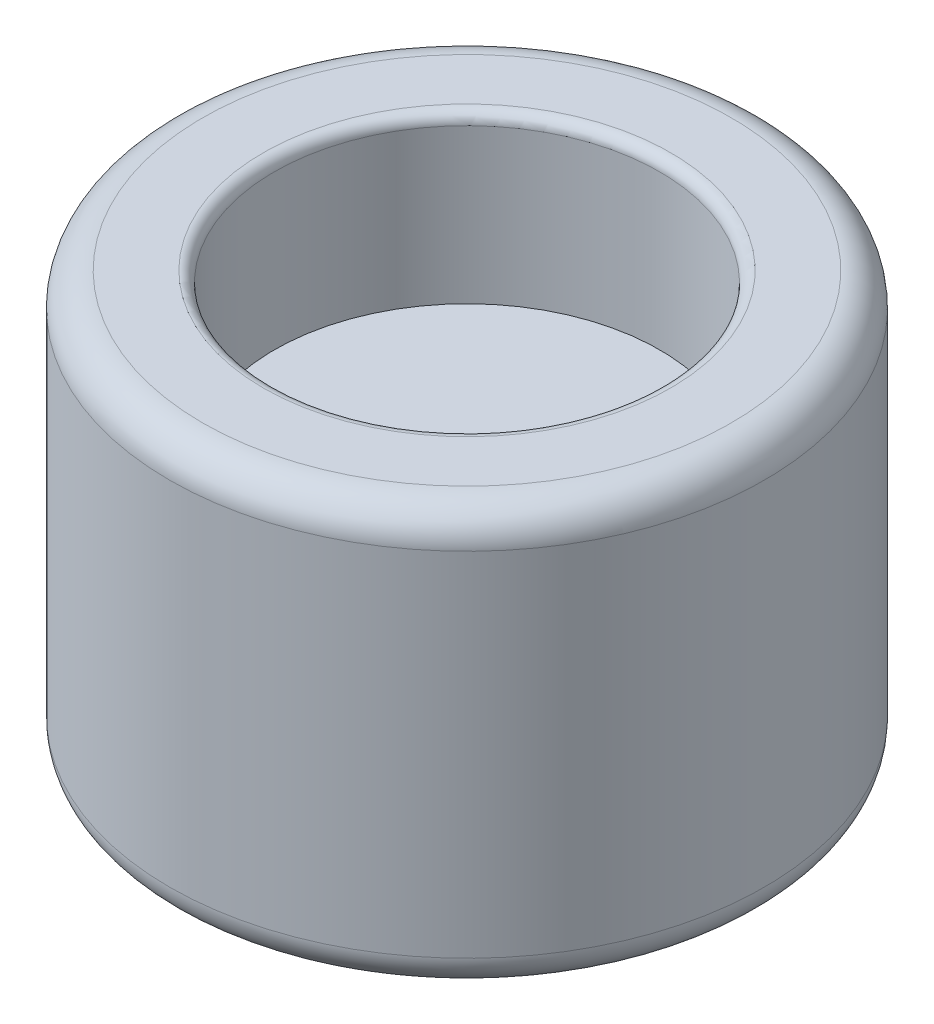
ISO-10303-21;
HEADER;
FILE_DESCRIPTION(('STEP AP214'),'2;1');
FILE_NAME('part.step','',(''),(''),'','','');
FILE_SCHEMA(('AUTOMOTIVE_DESIGN { 1 0 10303 214 1 1 1 1 }'));
ENDSEC;
DATA;
#1=APPLICATION_CONTEXT('core data for automotive mechanical design processes');
#2=APPLICATION_PROTOCOL_DEFINITION('international standard','automotive_design',2000,#1);
#3=PRODUCT_CONTEXT('',#1,'mechanical');
#4=PRODUCT('Part','Part','',(#3));
#5=PRODUCT_RELATED_PRODUCT_CATEGORY('part','',(#4));
#6=PRODUCT_DEFINITION_FORMATION('','',#4);
#7=PRODUCT_DEFINITION_CONTEXT('part definition',#1,'design');
#8=PRODUCT_DEFINITION('design','',#6,#7);
#9=PRODUCT_DEFINITION_SHAPE('','',#8);
#10=(LENGTH_UNIT() NAMED_UNIT(*) SI_UNIT(.MILLI.,.METRE.));
#11=(NAMED_UNIT(*) PLANE_ANGLE_UNIT() SI_UNIT($,.RADIAN.));
#12=(NAMED_UNIT(*) SI_UNIT($,.STERADIAN.) SOLID_ANGLE_UNIT());
#13=UNCERTAINTY_MEASURE_WITH_UNIT(LENGTH_MEASURE(1.E-05),#10,'distance_accuracy_value','');
#14=(GEOMETRIC_REPRESENTATION_CONTEXT(3) GLOBAL_UNCERTAINTY_ASSIGNED_CONTEXT((#13)) GLOBAL_UNIT_ASSIGNED_CONTEXT((#10,
#11,#12)) REPRESENTATION_CONTEXT('',''));
#15=CARTESIAN_POINT('',(0.,0.,0.));
#16=DIRECTION('',(0.,0.,1.));
#17=DIRECTION('',(1.,0.,0.));
#18=AXIS2_PLACEMENT_3D('',#15,#16,#17);
#19=CARTESIAN_POINT('',(0.,38.,0.));
#20=DIRECTION('',(0.,-1.,0.));
#21=DIRECTION('',(0.,0.,-1.));
#22=AXIS2_PLACEMENT_3D('',#19,#20,#21);
#23=CYLINDRICAL_SURFACE('',#22,27.);
#24=CARTESIAN_POINT('',(0.,3.,0.));
#25=DIRECTION('',(0.,1.,0.));
#26=DIRECTION('',(0.,0.,1.));
#27=AXIS2_PLACEMENT_3D('',#24,#25,#26);
#28=CIRCLE('',#27,27.);
#29=CARTESIAN_POINT('',(0.,3.,27.));
#30=VERTEX_POINT('',#29);
#31=EDGE_CURVE('E54',#30,#30,#28,.T.);
#32=ORIENTED_EDGE('',*,*,#31,.T.);
#33=EDGE_LOOP('',(#32));
#34=FACE_BOUND('',#33,.T.);
#35=CARTESIAN_POINT('',(0.,35.,0.));
#36=DIRECTION('',(0.,1.,0.));
#37=DIRECTION('',(0.,0.,1.));
#38=AXIS2_PLACEMENT_3D('',#35,#36,#37);
#39=CIRCLE('',#38,27.);
#40=CARTESIAN_POINT('',(0.,35.,27.));
#41=VERTEX_POINT('',#40);
#42=EDGE_CURVE('E57',#41,#41,#39,.F.);
#43=ORIENTED_EDGE('',*,*,#42,.T.);
#44=EDGE_LOOP('',(#43));
#45=FACE_BOUND('',#44,.T.);
#46=ADVANCED_FACE('F31',(#34,#45),#23,.T.);
#47=CARTESIAN_POINT('',(0.,38.,0.));
#48=DIRECTION('',(0.,1.,0.));
#49=DIRECTION('',(0.,0.,1.));
#50=AXIS2_PLACEMENT_3D('',#47,#48,#49);
#51=PLANE('',#50);
#52=CARTESIAN_POINT('',(0.,38.,0.));
#53=DIRECTION('',(0.,1.,0.));
#54=DIRECTION('',(0.,0.,1.));
#55=AXIS2_PLACEMENT_3D('',#52,#53,#54);
#56=CIRCLE('',#55,18.5);
#57=CARTESIAN_POINT('',(0.,38.,18.5));
#58=VERTEX_POINT('',#57);
#59=EDGE_CURVE('E42',#58,#58,#56,.F.);
#60=ORIENTED_EDGE('',*,*,#59,.T.);
#61=EDGE_LOOP('',(#60));
#62=FACE_BOUND('',#61,.T.);
#63=CARTESIAN_POINT('',(0.,38.,0.));
#64=DIRECTION('',(0.,1.,0.));
#65=DIRECTION('',(0.,0.,1.));
#66=AXIS2_PLACEMENT_3D('',#63,#64,#65);
#67=CIRCLE('',#66,24.);
#68=CARTESIAN_POINT('',(0.,38.,24.));
#69=VERTEX_POINT('',#68);
#70=EDGE_CURVE('E60',#69,#69,#67,.T.);
#71=ORIENTED_EDGE('',*,*,#70,.T.);
#72=EDGE_LOOP('',(#71));
#73=FACE_BOUND('',#72,.T.);
#74=ADVANCED_FACE('F96',(#62,#73),#51,.T.);
#75=CARTESIAN_POINT('',(0.,0.,0.));
#76=DIRECTION('',(0.,1.,0.));
#77=DIRECTION('',(0.,0.,1.));
#78=AXIS2_PLACEMENT_3D('',#75,#76,#77);
#79=PLANE('',#78);
#80=CARTESIAN_POINT('',(0.,0.,0.));
#81=DIRECTION('',(0.,1.,0.));
#82=DIRECTION('',(0.,0.,1.));
#83=AXIS2_PLACEMENT_3D('',#80,#81,#82);
#84=CIRCLE('',#83,18.5);
#85=CARTESIAN_POINT('',(0.,0.,18.5));
#86=VERTEX_POINT('',#85);
#87=EDGE_CURVE('E10',#86,#86,#84,.T.);
#88=ORIENTED_EDGE('',*,*,#87,.T.);
#89=EDGE_LOOP('',(#88));
#90=FACE_BOUND('',#89,.T.);
#91=CARTESIAN_POINT('',(0.,0.,0.));
#92=DIRECTION('',(0.,1.,0.));
#93=DIRECTION('',(0.,0.,1.));
#94=AXIS2_PLACEMENT_3D('',#91,#92,#93);
#95=CIRCLE('',#94,24.);
#96=CARTESIAN_POINT('',(0.,0.,24.));
#97=VERTEX_POINT('',#96);
#98=EDGE_CURVE('E51',#97,#97,#95,.F.);
#99=ORIENTED_EDGE('',*,*,#98,.T.);
#100=EDGE_LOOP('',(#99));
#101=FACE_BOUND('',#100,.T.);
#102=ADVANCED_FACE('F102',(#90,#101),#79,.F.);
#103=CARTESIAN_POINT('',(0.,35.,0.));
#104=DIRECTION('',(0.,1.,0.));
#105=DIRECTION('',(0.,0.,1.));
#106=AXIS2_PLACEMENT_3D('',#103,#104,#105);
#107=TOROIDAL_SURFACE('',#106,24.,3.);
#108=ORIENTED_EDGE('',*,*,#42,.F.);
#109=EDGE_LOOP('',(#108));
#110=FACE_BOUND('',#109,.T.);
#111=ORIENTED_EDGE('',*,*,#70,.F.);
#112=EDGE_LOOP('',(#111));
#113=FACE_BOUND('',#112,.T.);
#114=ADVANCED_FACE('F108',(#110,#113),#107,.T.);
#115=CARTESIAN_POINT('',(0.,3.,0.));
#116=DIRECTION('',(0.,1.,0.));
#117=DIRECTION('',(0.,0.,1.));
#118=AXIS2_PLACEMENT_3D('',#115,#116,#117);
#119=TOROIDAL_SURFACE('',#118,24.,3.);
#120=ORIENTED_EDGE('',*,*,#98,.F.);
#121=EDGE_LOOP('',(#120));
#122=FACE_BOUND('',#121,.T.);
#123=ORIENTED_EDGE('',*,*,#31,.F.);
#124=EDGE_LOOP('',(#123));
#125=FACE_BOUND('',#124,.T.);
#126=ADVANCED_FACE('F111',(#122,#125),#119,.T.);
#127=CARTESIAN_POINT('',(0.,15.,0.));
#128=DIRECTION('',(0.,-1.,0.));
#129=DIRECTION('',(0.,0.,-1.));
#130=AXIS2_PLACEMENT_3D('',#127,#128,#129);
#131=CYLINDRICAL_SURFACE('',#130,17.5);
#132=CARTESIAN_POINT('',(0.,1.,0.));
#133=DIRECTION('',(0.,1.,0.));
#134=DIRECTION('',(0.,0.,1.));
#135=AXIS2_PLACEMENT_3D('',#132,#133,#134);
#136=CIRCLE('',#135,17.5);
#137=CARTESIAN_POINT('',(0.,1.,17.5));
#138=VERTEX_POINT('',#137);
#139=EDGE_CURVE('E38',#138,#138,#136,.F.);
#140=ORIENTED_EDGE('',*,*,#139,.T.);
#141=EDGE_LOOP('',(#140));
#142=FACE_BOUND('',#141,.T.);
#143=CARTESIAN_POINT('',(0.,15.,0.));
#144=DIRECTION('',(0.,-1.,0.));
#145=DIRECTION('',(0.,0.,-1.));
#146=AXIS2_PLACEMENT_3D('',#143,#144,#145);
#147=CIRCLE('',#146,17.5);
#148=CARTESIAN_POINT('',(0.,15.,-17.5));
#149=VERTEX_POINT('',#148);
#150=EDGE_CURVE('E63',#149,#149,#147,.T.);
#151=ORIENTED_EDGE('',*,*,#150,.F.);
#152=EDGE_LOOP('',(#151));
#153=FACE_BOUND('',#152,.T.);
#154=ADVANCED_FACE('F92',(#142,#153),#131,.F.);
#155=CARTESIAN_POINT('',(0.,15.,0.));
#156=DIRECTION('',(0.,-1.,0.));
#157=DIRECTION('',(0.,0.,-1.));
#158=AXIS2_PLACEMENT_3D('',#155,#156,#157);
#159=PLANE('',#158);
#160=CARTESIAN_POINT('',(0.,15.,0.));
#161=DIRECTION('',(0.,-1.,0.));
#162=DIRECTION('',(0.,0.,-1.));
#163=AXIS2_PLACEMENT_3D('',#160,#161,#162);
#164=CIRCLE('',#163,3.);
#165=CARTESIAN_POINT('',(0.,15.,-3.));
#166=VERTEX_POINT('',#165);
#167=EDGE_CURVE('E69',#166,#166,#164,.T.);
#168=ORIENTED_EDGE('',*,*,#167,.F.);
#169=EDGE_LOOP('',(#168));
#170=FACE_BOUND('',#169,.T.);
#171=ORIENTED_EDGE('',*,*,#150,.T.);
#172=EDGE_LOOP('',(#171));
#173=FACE_BOUND('',#172,.T.);
#174=ADVANCED_FACE('F86',(#170,#173),#159,.T.);
#175=CARTESIAN_POINT('',(0.,23.,0.));
#176=DIRECTION('',(0.,1.,0.));
#177=DIRECTION('',(0.,0.,1.));
#178=AXIS2_PLACEMENT_3D('',#175,#176,#177);
#179=CYLINDRICAL_SURFACE('',#178,17.5);
#180=CARTESIAN_POINT('',(0.,37.,0.));
#181=DIRECTION('',(0.,1.,0.));
#182=DIRECTION('',(0.,0.,1.));
#183=AXIS2_PLACEMENT_3D('',#180,#181,#182);
#184=CIRCLE('',#183,17.5);
#185=CARTESIAN_POINT('',(0.,37.,17.5));
#186=VERTEX_POINT('',#185);
#187=EDGE_CURVE('E46',#186,#186,#184,.T.);
#188=ORIENTED_EDGE('',*,*,#187,.T.);
#189=EDGE_LOOP('',(#188));
#190=FACE_BOUND('',#189,.T.);
#191=CARTESIAN_POINT('',(0.,23.,0.));
#192=DIRECTION('',(0.,1.,0.));
#193=DIRECTION('',(0.,0.,1.));
#194=AXIS2_PLACEMENT_3D('',#191,#192,#193);
#195=CIRCLE('',#194,17.5);
#196=CARTESIAN_POINT('',(0.,23.,17.5));
#197=VERTEX_POINT('',#196);
#198=EDGE_CURVE('E66',#197,#197,#195,.T.);
#199=ORIENTED_EDGE('',*,*,#198,.F.);
#200=EDGE_LOOP('',(#199));
#201=FACE_BOUND('',#200,.T.);
#202=ADVANCED_FACE('F81',(#190,#201),#179,.F.);
#203=CARTESIAN_POINT('',(0.,23.,0.));
#204=DIRECTION('',(0.,1.,0.));
#205=DIRECTION('',(0.,0.,1.));
#206=AXIS2_PLACEMENT_3D('',#203,#204,#205);
#207=PLANE('',#206);
#208=CARTESIAN_POINT('',(0.,23.,0.));
#209=DIRECTION('',(0.,1.,0.));
#210=DIRECTION('',(0.,0.,1.));
#211=AXIS2_PLACEMENT_3D('',#208,#209,#210);
#212=CIRCLE('',#211,3.);
#213=CARTESIAN_POINT('',(0.,23.,3.));
#214=VERTEX_POINT('',#213);
#215=EDGE_CURVE('E72',#214,#214,#212,.T.);
#216=ORIENTED_EDGE('',*,*,#215,.F.);
#217=EDGE_LOOP('',(#216));
#218=FACE_BOUND('',#217,.T.);
#219=ORIENTED_EDGE('',*,*,#198,.T.);
#220=EDGE_LOOP('',(#219));
#221=FACE_BOUND('',#220,.T.);
#222=ADVANCED_FACE('F78',(#218,#221),#207,.T.);
#223=CARTESIAN_POINT('',(0.,8.,0.));
#224=DIRECTION('',(0.,1.,0.));
#225=DIRECTION('',(0.,0.,1.));
#226=AXIS2_PLACEMENT_3D('',#223,#224,#225);
#227=CYLINDRICAL_SURFACE('',#226,3.);
#228=ORIENTED_EDGE('',*,*,#167,.T.);
#229=EDGE_LOOP('',(#228));
#230=FACE_BOUND('',#229,.T.);
#231=ORIENTED_EDGE('',*,*,#215,.T.);
#232=EDGE_LOOP('',(#231));
#233=FACE_BOUND('',#232,.T.);
#234=ADVANCED_FACE('F76',(#230,#233),#227,.F.);
#235=CARTESIAN_POINT('',(0.,37.,0.));
#236=DIRECTION('',(0.,1.,0.));
#237=DIRECTION('',(0.,0.,1.));
#238=AXIS2_PLACEMENT_3D('',#235,#236,#237);
#239=TOROIDAL_SURFACE('',#238,18.5,1.);
#240=ORIENTED_EDGE('',*,*,#59,.F.);
#241=EDGE_LOOP('',(#240));
#242=FACE_BOUND('',#241,.T.);
#243=ORIENTED_EDGE('',*,*,#187,.F.);
#244=EDGE_LOOP('',(#243));
#245=FACE_BOUND('',#244,.T.);
#246=ADVANCED_FACE('F115',(#242,#245),#239,.T.);
#247=CARTESIAN_POINT('',(0.,1.,0.));
#248=DIRECTION('',(0.,1.,0.));
#249=DIRECTION('',(0.,0.,1.));
#250=AXIS2_PLACEMENT_3D('',#247,#248,#249);
#251=TOROIDAL_SURFACE('',#250,18.5,1.);
#252=ORIENTED_EDGE('',*,*,#87,.F.);
#253=EDGE_LOOP('',(#252));
#254=FACE_BOUND('',#253,.T.);
#255=ORIENTED_EDGE('',*,*,#139,.F.);
#256=EDGE_LOOP('',(#255));
#257=FACE_BOUND('',#256,.T.);
#258=ADVANCED_FACE('F33',(#254,#257),#251,.T.);
#259=CLOSED_SHELL('',(#46,#74,#102,#114,#126,#154,#174,#202,#222,#234,#246,#258));
#260=MANIFOLD_SOLID_BREP('B2',#259);
#261=ADVANCED_BREP_SHAPE_REPRESENTATION('',(#18,#260),#14);
#262=SHAPE_DEFINITION_REPRESENTATION(#9,#261);
ENDSEC;
END-ISO-10303-21;
